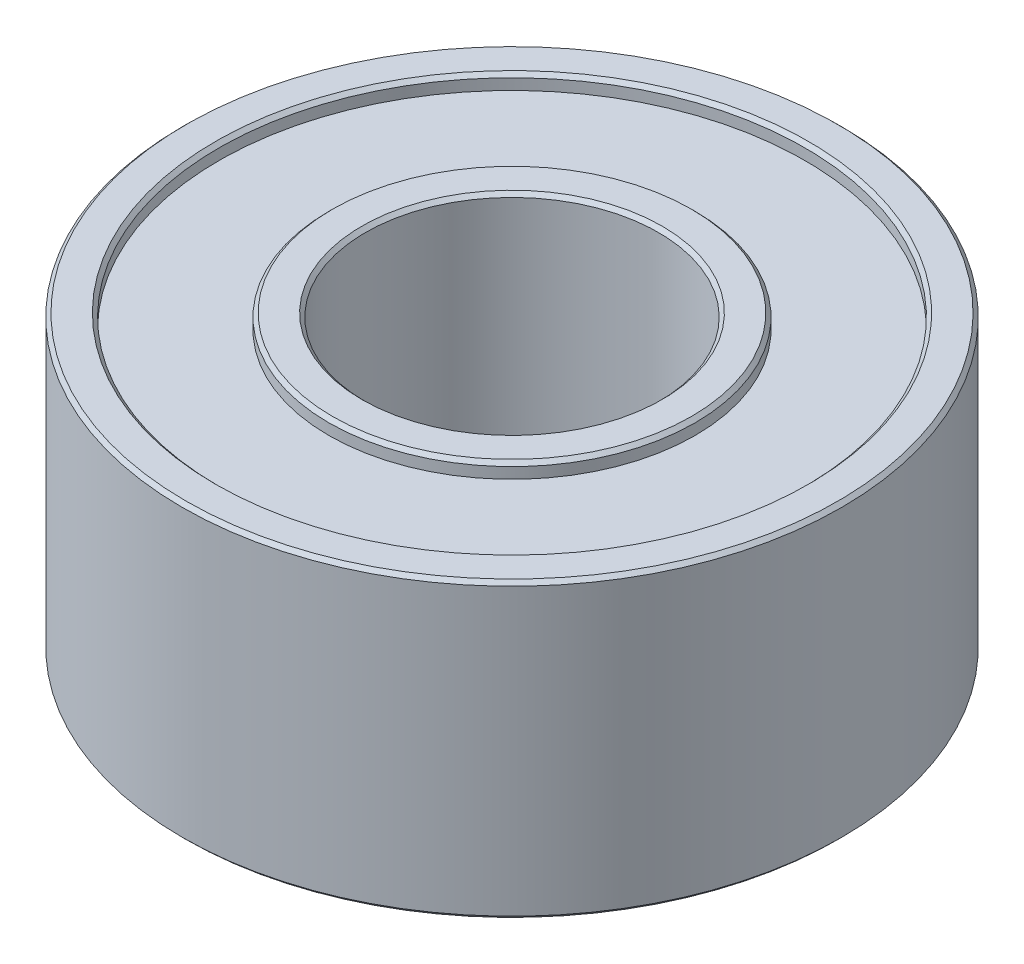
ISO-10303-21;
HEADER;
FILE_DESCRIPTION(('STEP AP214'),'2;1');
FILE_NAME('part.step','',(''),(''),'','','');
FILE_SCHEMA(('AUTOMOTIVE_DESIGN { 1 0 10303 214 1 1 1 1 }'));
ENDSEC;
DATA;
#1=APPLICATION_CONTEXT('core data for automotive mechanical design processes');
#2=APPLICATION_PROTOCOL_DEFINITION('international standard','automotive_design',2000,#1);
#3=PRODUCT_CONTEXT('',#1,'mechanical');
#4=PRODUCT('Part','Part','',(#3));
#5=PRODUCT_RELATED_PRODUCT_CATEGORY('part','',(#4));
#6=PRODUCT_DEFINITION_FORMATION('','',#4);
#7=PRODUCT_DEFINITION_CONTEXT('part definition',#1,'design');
#8=PRODUCT_DEFINITION('design','',#6,#7);
#9=PRODUCT_DEFINITION_SHAPE('','',#8);
#10=(LENGTH_UNIT() NAMED_UNIT(*) SI_UNIT(.MILLI.,.METRE.));
#11=(NAMED_UNIT(*) PLANE_ANGLE_UNIT() SI_UNIT($,.RADIAN.));
#12=(NAMED_UNIT(*) SI_UNIT($,.STERADIAN.) SOLID_ANGLE_UNIT());
#13=UNCERTAINTY_MEASURE_WITH_UNIT(LENGTH_MEASURE(1.E-05),#10,'distance_accuracy_value','');
#14=(GEOMETRIC_REPRESENTATION_CONTEXT(3) GLOBAL_UNCERTAINTY_ASSIGNED_CONTEXT((#13)) GLOBAL_UNIT_ASSIGNED_CONTEXT((#10,
#11,#12)) REPRESENTATION_CONTEXT('',''));
#15=CARTESIAN_POINT('',(0.,0.,0.));
#16=DIRECTION('',(0.,0.,1.));
#17=DIRECTION('',(1.,0.,0.));
#18=AXIS2_PLACEMENT_3D('',#15,#16,#17);
#19=CARTESIAN_POINT('',(0.,-2.,0.));
#20=DIRECTION('',(0.,1.,0.));
#21=DIRECTION('',(0.,0.,1.));
#22=AXIS2_PLACEMENT_3D('',#19,#20,#21);
#23=PLANE('',#22);
#24=CARTESIAN_POINT('',(0.,-2.,0.));
#25=DIRECTION('',(0.,1.,0.));
#26=DIRECTION('',(0.,0.,1.));
#27=AXIS2_PLACEMENT_3D('',#24,#25,#26);
#28=CIRCLE('',#27,2.45);
#29=CARTESIAN_POINT('',(0.,-2.,2.45));
#30=VERTEX_POINT('',#29);
#31=EDGE_CURVE('E65',#30,#30,#28,.F.);
#32=ORIENTED_EDGE('',*,*,#31,.T.);
#33=EDGE_LOOP('',(#32));
#34=FACE_BOUND('',#33,.T.);
#35=CARTESIAN_POINT('',(0.,-2.,0.));
#36=DIRECTION('',(0.,1.,0.));
#37=DIRECTION('',(0.,0.,1.));
#38=AXIS2_PLACEMENT_3D('',#35,#36,#37);
#39=CIRCLE('',#38,2.05);
#40=CARTESIAN_POINT('',(0.,-2.,2.05));
#41=VERTEX_POINT('',#40);
#42=EDGE_CURVE('E68',#41,#41,#39,.T.);
#43=ORIENTED_EDGE('',*,*,#42,.T.);
#44=EDGE_LOOP('',(#43));
#45=FACE_BOUND('',#44,.T.);
#46=ADVANCED_FACE('F41',(#34,#45),#23,.F.);
#47=CARTESIAN_POINT('',(0.,2.,0.));
#48=DIRECTION('',(0.,1.,0.));
#49=DIRECTION('',(0.,0.,1.));
#50=AXIS2_PLACEMENT_3D('',#47,#48,#49);
#51=PLANE('',#50);
#52=CARTESIAN_POINT('',(0.,2.,0.));
#53=DIRECTION('',(0.,1.,0.));
#54=DIRECTION('',(0.,0.,1.));
#55=AXIS2_PLACEMENT_3D('',#52,#53,#54);
#56=CIRCLE('',#55,2.45);
#57=CARTESIAN_POINT('',(0.,2.,2.45));
#58=VERTEX_POINT('',#57);
#59=EDGE_CURVE('E92',#58,#58,#56,.T.);
#60=ORIENTED_EDGE('',*,*,#59,.T.);
#61=EDGE_LOOP('',(#60));
#62=FACE_BOUND('',#61,.T.);
#63=CARTESIAN_POINT('',(0.,2.,0.));
#64=DIRECTION('',(0.,1.,0.));
#65=DIRECTION('',(0.,0.,1.));
#66=AXIS2_PLACEMENT_3D('',#63,#64,#65);
#67=CIRCLE('',#66,2.05);
#68=CARTESIAN_POINT('',(0.,2.,2.05));
#69=VERTEX_POINT('',#68);
#70=EDGE_CURVE('E95',#69,#69,#67,.F.);
#71=ORIENTED_EDGE('',*,*,#70,.T.);
#72=EDGE_LOOP('',(#71));
#73=FACE_BOUND('',#72,.T.);
#74=ADVANCED_FACE('F130',(#62,#73),#51,.T.);
#75=CARTESIAN_POINT('',(0.,2.,0.));
#76=DIRECTION('',(0.,1.,0.));
#77=DIRECTION('',(0.,0.,1.));
#78=AXIS2_PLACEMENT_3D('',#75,#76,#77);
#79=CIRCLE('',#78,4.45);
#80=CARTESIAN_POINT('',(0.,2.,4.45));
#81=VERTEX_POINT('',#80);
#82=EDGE_CURVE('E49',#81,#81,#79,.T.);
#83=ORIENTED_EDGE('',*,*,#82,.T.);
#84=EDGE_LOOP('',(#83));
#85=FACE_BOUND('',#84,.T.);
#86=CARTESIAN_POINT('',(0.,2.,0.));
#87=DIRECTION('',(0.,1.,0.));
#88=DIRECTION('',(0.,0.,1.));
#89=AXIS2_PLACEMENT_3D('',#86,#87,#88);
#90=CIRCLE('',#89,4.05);
#91=CARTESIAN_POINT('',(0.,2.,4.05));
#92=VERTEX_POINT('',#91);
#93=EDGE_CURVE('E53',#92,#92,#90,.F.);
#94=ORIENTED_EDGE('',*,*,#93,.T.);
#95=EDGE_LOOP('',(#94));
#96=FACE_BOUND('',#95,.T.);
#97=ADVANCED_FACE('F137',(#85,#96),#51,.T.);
#98=CARTESIAN_POINT('',(0.,-2.,0.));
#99=DIRECTION('',(0.,1.,0.));
#100=DIRECTION('',(0.,0.,1.));
#101=AXIS2_PLACEMENT_3D('',#98,#99,#100);
#102=CIRCLE('',#101,4.45);
#103=CARTESIAN_POINT('',(0.,-2.,4.45));
#104=VERTEX_POINT('',#103);
#105=EDGE_CURVE('E77',#104,#104,#102,.F.);
#106=ORIENTED_EDGE('',*,*,#105,.T.);
#107=EDGE_LOOP('',(#106));
#108=FACE_BOUND('',#107,.T.);
#109=CARTESIAN_POINT('',(0.,-2.,0.));
#110=DIRECTION('',(0.,1.,0.));
#111=DIRECTION('',(0.,0.,1.));
#112=AXIS2_PLACEMENT_3D('',#109,#110,#111);
#113=CIRCLE('',#112,4.05);
#114=CARTESIAN_POINT('',(0.,-2.,4.05));
#115=VERTEX_POINT('',#114);
#116=EDGE_CURVE('E80',#115,#115,#113,.T.);
#117=ORIENTED_EDGE('',*,*,#116,.T.);
#118=EDGE_LOOP('',(#117));
#119=FACE_BOUND('',#118,.T.);
#120=ADVANCED_FACE('F133',(#108,#119),#23,.F.);
#121=CARTESIAN_POINT('',(0.,2.,0.));
#122=DIRECTION('',(0.,-1.,0.));
#123=DIRECTION('',(0.,0.,-1.));
#124=AXIS2_PLACEMENT_3D('',#121,#122,#123);
#125=CYLINDRICAL_SURFACE('',#124,4.5);
#126=CARTESIAN_POINT('',(0.,-1.95,0.));
#127=DIRECTION('',(0.,1.,0.));
#128=DIRECTION('',(0.,0.,1.));
#129=AXIS2_PLACEMENT_3D('',#126,#127,#128);
#130=CIRCLE('',#129,4.5);
#131=CARTESIAN_POINT('',(0.,-1.95,4.5));
#132=VERTEX_POINT('',#131);
#133=EDGE_CURVE('E83',#132,#132,#130,.T.);
#134=ORIENTED_EDGE('',*,*,#133,.T.);
#135=EDGE_LOOP('',(#134));
#136=FACE_BOUND('',#135,.T.);
#137=CARTESIAN_POINT('',(0.,1.95,0.));
#138=DIRECTION('',(0.,1.,0.));
#139=DIRECTION('',(0.,0.,1.));
#140=AXIS2_PLACEMENT_3D('',#137,#138,#139);
#141=CIRCLE('',#140,4.5);
#142=CARTESIAN_POINT('',(0.,1.95,4.5));
#143=VERTEX_POINT('',#142);
#144=EDGE_CURVE('E86',#143,#143,#141,.F.);
#145=ORIENTED_EDGE('',*,*,#144,.T.);
#146=EDGE_LOOP('',(#145));
#147=FACE_BOUND('',#146,.T.);
#148=ADVANCED_FACE('F143',(#136,#147),#125,.T.);
#149=CARTESIAN_POINT('',(0.,2.,0.));
#150=DIRECTION('',(0.,-1.,0.));
#151=DIRECTION('',(0.,0.,-1.));
#152=AXIS2_PLACEMENT_3D('',#149,#150,#151);
#153=CYLINDRICAL_SURFACE('',#152,2.);
#154=CARTESIAN_POINT('',(0.,-1.95,0.));
#155=DIRECTION('',(0.,1.,0.));
#156=DIRECTION('',(0.,0.,1.));
#157=AXIS2_PLACEMENT_3D('',#154,#155,#156);
#158=CIRCLE('',#157,2.);
#159=CARTESIAN_POINT('',(0.,-1.95,2.));
#160=VERTEX_POINT('',#159);
#161=EDGE_CURVE('E57',#160,#160,#158,.F.);
#162=ORIENTED_EDGE('',*,*,#161,.T.);
#163=EDGE_LOOP('',(#162));
#164=FACE_BOUND('',#163,.T.);
#165=CARTESIAN_POINT('',(0.,1.95,0.));
#166=DIRECTION('',(0.,1.,0.));
#167=DIRECTION('',(0.,0.,1.));
#168=AXIS2_PLACEMENT_3D('',#165,#166,#167);
#169=CIRCLE('',#168,2.);
#170=CARTESIAN_POINT('',(0.,1.95,2.));
#171=VERTEX_POINT('',#170);
#172=EDGE_CURVE('E62',#171,#171,#169,.T.);
#173=ORIENTED_EDGE('',*,*,#172,.T.);
#174=EDGE_LOOP('',(#173));
#175=FACE_BOUND('',#174,.T.);
#176=ADVANCED_FACE('F149',(#164,#175),#153,.F.);
#177=CARTESIAN_POINT('',(0.,1.8,0.));
#178=DIRECTION('',(0.,1.,0.));
#179=DIRECTION('',(0.,0.,1.));
#180=AXIS2_PLACEMENT_3D('',#177,#178,#179);
#181=CYLINDRICAL_SURFACE('',#180,4.);
#182=CARTESIAN_POINT('',(0.,1.95,0.));
#183=DIRECTION('',(0.,1.,0.));
#184=DIRECTION('',(0.,0.,1.));
#185=AXIS2_PLACEMENT_3D('',#182,#183,#184);
#186=CIRCLE('',#185,4.);
#187=CARTESIAN_POINT('',(0.,1.95,4.));
#188=VERTEX_POINT('',#187);
#189=EDGE_CURVE('E10',#188,#188,#186,.T.);
#190=ORIENTED_EDGE('',*,*,#189,.T.);
#191=EDGE_LOOP('',(#190));
#192=FACE_BOUND('',#191,.T.);
#193=CARTESIAN_POINT('',(0.,1.8,0.));
#194=DIRECTION('',(0.,1.,0.));
#195=DIRECTION('',(0.,0.,1.));
#196=AXIS2_PLACEMENT_3D('',#193,#194,#195);
#197=CIRCLE('',#196,4.);
#198=CARTESIAN_POINT('',(0.,1.8,4.));
#199=VERTEX_POINT('',#198);
#200=EDGE_CURVE('E98',#199,#199,#197,.T.);
#201=ORIENTED_EDGE('',*,*,#200,.F.);
#202=EDGE_LOOP('',(#201));
#203=FACE_BOUND('',#202,.T.);
#204=ADVANCED_FACE('F210',(#192,#203),#181,.F.);
#205=CARTESIAN_POINT('',(0.,1.8,0.));
#206=DIRECTION('',(0.,1.,0.));
#207=DIRECTION('',(0.,0.,1.));
#208=AXIS2_PLACEMENT_3D('',#205,#206,#207);
#209=PLANE('',#208);
#210=CARTESIAN_POINT('',(0.,1.8,0.));
#211=DIRECTION('',(0.,1.,0.));
#212=DIRECTION('',(0.,0.,1.));
#213=AXIS2_PLACEMENT_3D('',#210,#211,#212);
#214=CIRCLE('',#213,2.5);
#215=CARTESIAN_POINT('',(0.,1.8,2.5));
#216=VERTEX_POINT('',#215);
#217=EDGE_CURVE('E101',#216,#216,#214,.T.);
#218=ORIENTED_EDGE('',*,*,#217,.F.);
#219=EDGE_LOOP('',(#218));
#220=FACE_BOUND('',#219,.T.);
#221=ORIENTED_EDGE('',*,*,#200,.T.);
#222=EDGE_LOOP('',(#221));
#223=FACE_BOUND('',#222,.T.);
#224=ADVANCED_FACE('F216',(#220,#223),#209,.T.);
#225=CARTESIAN_POINT('',(0.,1.8,0.));
#226=DIRECTION('',(0.,1.,0.));
#227=DIRECTION('',(0.,0.,1.));
#228=AXIS2_PLACEMENT_3D('',#225,#226,#227);
#229=CYLINDRICAL_SURFACE('',#228,2.5);
#230=CARTESIAN_POINT('',(0.,1.95,0.));
#231=DIRECTION('',(0.,1.,0.));
#232=DIRECTION('',(0.,0.,1.));
#233=AXIS2_PLACEMENT_3D('',#230,#231,#232);
#234=CIRCLE('',#233,2.5);
#235=CARTESIAN_POINT('',(0.,1.95,2.5));
#236=VERTEX_POINT('',#235);
#237=EDGE_CURVE('E89',#236,#236,#234,.F.);
#238=ORIENTED_EDGE('',*,*,#237,.T.);
#239=EDGE_LOOP('',(#238));
#240=FACE_BOUND('',#239,.T.);
#241=ORIENTED_EDGE('',*,*,#217,.T.);
#242=EDGE_LOOP('',(#241));
#243=FACE_BOUND('',#242,.T.);
#244=ADVANCED_FACE('F221',(#240,#243),#229,.T.);
#245=CARTESIAN_POINT('',(0.,-1.8,0.));
#246=DIRECTION('',(0.,1.,0.));
#247=DIRECTION('',(0.,0.,1.));
#248=AXIS2_PLACEMENT_3D('',#245,#246,#247);
#249=PLANE('',#248);
#250=CARTESIAN_POINT('',(0.,-1.8,0.));
#251=DIRECTION('',(0.,1.,0.));
#252=DIRECTION('',(0.,0.,1.));
#253=AXIS2_PLACEMENT_3D('',#250,#251,#252);
#254=CIRCLE('',#253,4.);
#255=CARTESIAN_POINT('',(0.,-1.8,4.));
#256=VERTEX_POINT('',#255);
#257=EDGE_CURVE('E104',#256,#256,#254,.T.);
#258=ORIENTED_EDGE('',*,*,#257,.F.);
#259=EDGE_LOOP('',(#258));
#260=FACE_BOUND('',#259,.T.);
#261=CARTESIAN_POINT('',(0.,-1.8,0.));
#262=DIRECTION('',(0.,1.,0.));
#263=DIRECTION('',(0.,0.,1.));
#264=AXIS2_PLACEMENT_3D('',#261,#262,#263);
#265=CIRCLE('',#264,2.5);
#266=CARTESIAN_POINT('',(0.,-1.8,2.5));
#267=VERTEX_POINT('',#266);
#268=EDGE_CURVE('E107',#267,#267,#265,.T.);
#269=ORIENTED_EDGE('',*,*,#268,.T.);
#270=EDGE_LOOP('',(#269));
#271=FACE_BOUND('',#270,.T.);
#272=ADVANCED_FACE('F111',(#260,#271),#249,.F.);
#273=CARTESIAN_POINT('',(0.,-1.8,0.));
#274=DIRECTION('',(0.,-1.,0.));
#275=DIRECTION('',(0.,0.,-1.));
#276=AXIS2_PLACEMENT_3D('',#273,#274,#275);
#277=CYLINDRICAL_SURFACE('',#276,4.);
#278=CARTESIAN_POINT('',(0.,-1.95,0.));
#279=DIRECTION('',(0.,1.,0.));
#280=DIRECTION('',(0.,0.,1.));
#281=AXIS2_PLACEMENT_3D('',#278,#279,#280);
#282=CIRCLE('',#281,4.);
#283=CARTESIAN_POINT('',(0.,-1.95,4.));
#284=VERTEX_POINT('',#283);
#285=EDGE_CURVE('E74',#284,#284,#282,.F.);
#286=ORIENTED_EDGE('',*,*,#285,.T.);
#287=EDGE_LOOP('',(#286));
#288=FACE_BOUND('',#287,.T.);
#289=ORIENTED_EDGE('',*,*,#257,.T.);
#290=EDGE_LOOP('',(#289));
#291=FACE_BOUND('',#290,.T.);
#292=ADVANCED_FACE('F116',(#288,#291),#277,.F.);
#293=CARTESIAN_POINT('',(0.,-1.8,0.));
#294=DIRECTION('',(0.,-1.,0.));
#295=DIRECTION('',(0.,0.,-1.));
#296=AXIS2_PLACEMENT_3D('',#293,#294,#295);
#297=CYLINDRICAL_SURFACE('',#296,2.5);
#298=CARTESIAN_POINT('',(0.,-1.95,0.));
#299=DIRECTION('',(0.,1.,0.));
#300=DIRECTION('',(0.,0.,1.));
#301=AXIS2_PLACEMENT_3D('',#298,#299,#300);
#302=CIRCLE('',#301,2.5);
#303=CARTESIAN_POINT('',(0.,-1.95,2.5));
#304=VERTEX_POINT('',#303);
#305=EDGE_CURVE('E71',#304,#304,#302,.T.);
#306=ORIENTED_EDGE('',*,*,#305,.T.);
#307=EDGE_LOOP('',(#306));
#308=FACE_BOUND('',#307,.T.);
#309=ORIENTED_EDGE('',*,*,#268,.F.);
#310=EDGE_LOOP('',(#309));
#311=FACE_BOUND('',#310,.T.);
#312=ADVANCED_FACE('F113',(#308,#311),#297,.T.);
#313=CARTESIAN_POINT('',(0.,2.,0.));
#314=DIRECTION('',(0.,-1.,0.));
#315=DIRECTION('',(0.,0.,-1.));
#316=AXIS2_PLACEMENT_3D('',#313,#314,#315);
#317=CONICAL_SURFACE('',#316,2.45,0.785398163397448);
#318=ORIENTED_EDGE('',*,*,#237,.F.);
#319=EDGE_LOOP('',(#318));
#320=FACE_BOUND('',#319,.T.);
#321=ORIENTED_EDGE('',*,*,#59,.F.);
#322=EDGE_LOOP('',(#321));
#323=FACE_BOUND('',#322,.T.);
#324=ADVANCED_FACE('F115',(#320,#323),#317,.T.);
#325=CARTESIAN_POINT('',(0.,-1.95,0.));
#326=DIRECTION('',(0.,1.,0.));
#327=DIRECTION('',(0.,0.,1.));
#328=AXIS2_PLACEMENT_3D('',#325,#326,#327);
#329=CONICAL_SURFACE('',#328,4.5,0.785398163397448);
#330=ORIENTED_EDGE('',*,*,#105,.F.);
#331=EDGE_LOOP('',(#330));
#332=FACE_BOUND('',#331,.T.);
#333=ORIENTED_EDGE('',*,*,#133,.F.);
#334=EDGE_LOOP('',(#333));
#335=FACE_BOUND('',#334,.T.);
#336=ADVANCED_FACE('F123',(#332,#335),#329,.T.);
#337=CARTESIAN_POINT('',(0.,-2.,0.));
#338=DIRECTION('',(0.,-1.,0.));
#339=DIRECTION('',(0.,0.,-1.));
#340=AXIS2_PLACEMENT_3D('',#337,#338,#339);
#341=CONICAL_SURFACE('',#340,4.05,0.785398163397457);
#342=ORIENTED_EDGE('',*,*,#285,.F.);
#343=EDGE_LOOP('',(#342));
#344=FACE_BOUND('',#343,.T.);
#345=ORIENTED_EDGE('',*,*,#116,.F.);
#346=EDGE_LOOP('',(#345));
#347=FACE_BOUND('',#346,.T.);
#348=ADVANCED_FACE('F155',(#344,#347),#341,.F.);
#349=CARTESIAN_POINT('',(0.,-1.95,0.));
#350=DIRECTION('',(0.,1.,0.));
#351=DIRECTION('',(0.,0.,1.));
#352=AXIS2_PLACEMENT_3D('',#349,#350,#351);
#353=CONICAL_SURFACE('',#352,2.5,0.785398163397448);
#354=ORIENTED_EDGE('',*,*,#31,.F.);
#355=EDGE_LOOP('',(#354));
#356=FACE_BOUND('',#355,.T.);
#357=ORIENTED_EDGE('',*,*,#305,.F.);
#358=EDGE_LOOP('',(#357));
#359=FACE_BOUND('',#358,.T.);
#360=ADVANCED_FACE('F157',(#356,#359),#353,.T.);
#361=CARTESIAN_POINT('',(0.,-2.,0.));
#362=DIRECTION('',(0.,-1.,0.));
#363=DIRECTION('',(0.,0.,-1.));
#364=AXIS2_PLACEMENT_3D('',#361,#362,#363);
#365=CONICAL_SURFACE('',#364,2.05,0.785398163397448);
#366=ORIENTED_EDGE('',*,*,#161,.F.);
#367=EDGE_LOOP('',(#366));
#368=FACE_BOUND('',#367,.T.);
#369=ORIENTED_EDGE('',*,*,#42,.F.);
#370=EDGE_LOOP('',(#369));
#371=FACE_BOUND('',#370,.T.);
#372=ADVANCED_FACE('F164',(#368,#371),#365,.F.);
#373=CARTESIAN_POINT('',(0.,2.,0.));
#374=DIRECTION('',(0.,-1.,0.));
#375=DIRECTION('',(0.,0.,-1.));
#376=AXIS2_PLACEMENT_3D('',#373,#374,#375);
#377=CONICAL_SURFACE('',#376,4.45,0.785398163397448);
#378=ORIENTED_EDGE('',*,*,#144,.F.);
#379=EDGE_LOOP('',(#378));
#380=FACE_BOUND('',#379,.T.);
#381=ORIENTED_EDGE('',*,*,#82,.F.);
#382=EDGE_LOOP('',(#381));
#383=FACE_BOUND('',#382,.T.);
#384=ADVANCED_FACE('F184',(#380,#383),#377,.T.);
#385=CARTESIAN_POINT('',(0.,1.95,0.));
#386=DIRECTION('',(0.,1.,0.));
#387=DIRECTION('',(0.,0.,1.));
#388=AXIS2_PLACEMENT_3D('',#385,#386,#387);
#389=CONICAL_SURFACE('',#388,4.,0.785398163397448);
#390=ORIENTED_EDGE('',*,*,#93,.F.);
#391=EDGE_LOOP('',(#390));
#392=FACE_BOUND('',#391,.T.);
#393=ORIENTED_EDGE('',*,*,#189,.F.);
#394=EDGE_LOOP('',(#393));
#395=FACE_BOUND('',#394,.T.);
#396=ADVANCED_FACE('F190',(#392,#395),#389,.F.);
#397=CARTESIAN_POINT('',(0.,1.95,0.));
#398=DIRECTION('',(0.,1.,0.));
#399=DIRECTION('',(0.,0.,1.));
#400=AXIS2_PLACEMENT_3D('',#397,#398,#399);
#401=CONICAL_SURFACE('',#400,2.,0.785398163397448);
#402=ORIENTED_EDGE('',*,*,#70,.F.);
#403=EDGE_LOOP('',(#402));
#404=FACE_BOUND('',#403,.T.);
#405=ORIENTED_EDGE('',*,*,#172,.F.);
#406=EDGE_LOOP('',(#405));
#407=FACE_BOUND('',#406,.T.);
#408=ADVANCED_FACE('F44',(#404,#407),#401,.F.);
#409=CLOSED_SHELL('',(#46,#74,#97,#120,#148,#176,#204,#224,#244,#272,#292,#312,#324,#336,#348,
#360,#372,#384,#396,#408));
#410=MANIFOLD_SOLID_BREP('B2',#409);
#411=ADVANCED_BREP_SHAPE_REPRESENTATION('',(#18,#410),#14);
#412=SHAPE_DEFINITION_REPRESENTATION(#9,#411);
ENDSEC;
END-ISO-10303-21;
